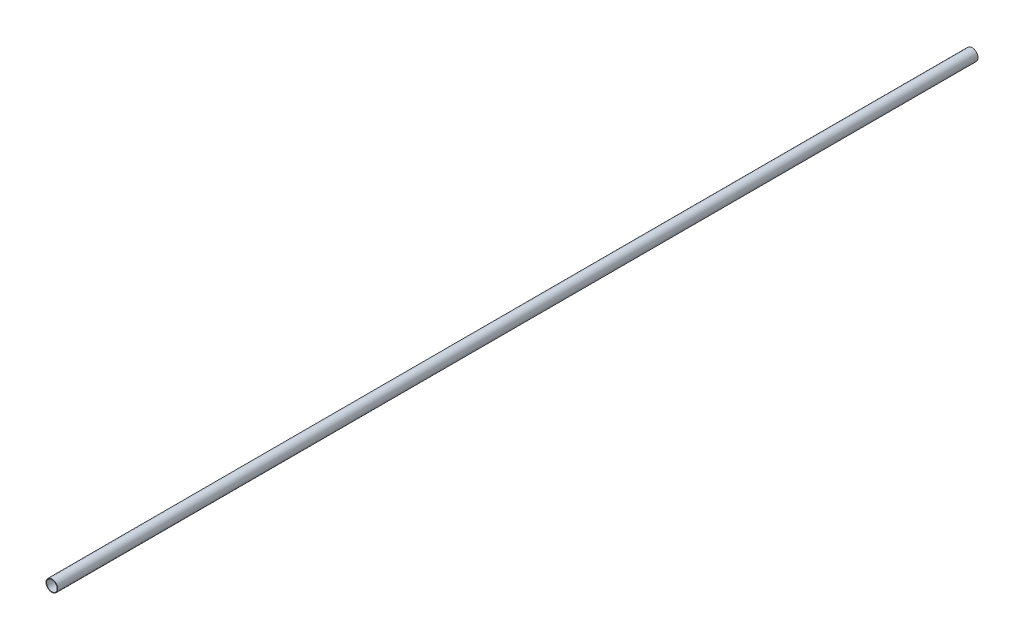
ISO-10303-21;
HEADER;
FILE_DESCRIPTION(('STEP AP214'),'2;1');
FILE_NAME('part.step','',(''),(''),'','','');
FILE_SCHEMA(('AUTOMOTIVE_DESIGN { 1 0 10303 214 1 1 1 1 }'));
ENDSEC;
DATA;
#1=APPLICATION_CONTEXT('core data for automotive mechanical design processes');
#2=APPLICATION_PROTOCOL_DEFINITION('international standard','automotive_design',2000,#1);
#3=PRODUCT_CONTEXT('',#1,'mechanical');
#4=PRODUCT('Part','Part','',(#3));
#5=PRODUCT_RELATED_PRODUCT_CATEGORY('part','',(#4));
#6=PRODUCT_DEFINITION_FORMATION('','',#4);
#7=PRODUCT_DEFINITION_CONTEXT('part definition',#1,'design');
#8=PRODUCT_DEFINITION('design','',#6,#7);
#9=PRODUCT_DEFINITION_SHAPE('','',#8);
#10=(LENGTH_UNIT() NAMED_UNIT(*) SI_UNIT(.MILLI.,.METRE.));
#11=(NAMED_UNIT(*) PLANE_ANGLE_UNIT() SI_UNIT($,.RADIAN.));
#12=(NAMED_UNIT(*) SI_UNIT($,.STERADIAN.) SOLID_ANGLE_UNIT());
#13=UNCERTAINTY_MEASURE_WITH_UNIT(LENGTH_MEASURE(1.E-05),#10,'distance_accuracy_value','');
#14=(GEOMETRIC_REPRESENTATION_CONTEXT(3) GLOBAL_UNCERTAINTY_ASSIGNED_CONTEXT((#13)) GLOBAL_UNIT_ASSIGNED_CONTEXT((#10,
#11,#12)) REPRESENTATION_CONTEXT('',''));
#15=CARTESIAN_POINT('',(0.,0.,0.));
#16=DIRECTION('',(0.,0.,1.));
#17=DIRECTION('',(1.,0.,0.));
#18=AXIS2_PLACEMENT_3D('',#15,#16,#17);
#19=CARTESIAN_POINT('',(0.,0.,392.));
#20=DIRECTION('',(0.,0.,1.));
#21=DIRECTION('',(1.,0.,0.));
#22=AXIS2_PLACEMENT_3D('',#19,#20,#21);
#23=PLANE('',#22);
#24=CARTESIAN_POINT('',(0.,0.,392.));
#25=DIRECTION('',(0.,0.,1.));
#26=DIRECTION('',(1.,0.,0.));
#27=AXIS2_PLACEMENT_3D('',#24,#25,#26);
#28=CIRCLE('',#27,5.);
#29=CARTESIAN_POINT('',(5.,0.,392.));
#30=VERTEX_POINT('',#29);
#31=EDGE_CURVE('E10',#30,#30,#28,.T.);
#32=ORIENTED_EDGE('',*,*,#31,.T.);
#33=EDGE_LOOP('',(#32));
#34=FACE_BOUND('',#33,.T.);
#35=CARTESIAN_POINT('',(0.,0.,392.));
#36=DIRECTION('',(0.,0.,1.));
#37=DIRECTION('',(1.,0.,0.));
#38=AXIS2_PLACEMENT_3D('',#35,#36,#37);
#39=CIRCLE('',#38,4.5);
#40=CARTESIAN_POINT('',(4.5,0.,392.));
#41=VERTEX_POINT('',#40);
#42=EDGE_CURVE('E42',#41,#41,#39,.T.);
#43=ORIENTED_EDGE('',*,*,#42,.F.);
#44=EDGE_LOOP('',(#43));
#45=FACE_BOUND('',#44,.T.);
#46=ADVANCED_FACE('F31',(#34,#45),#23,.T.);
#47=CARTESIAN_POINT('',(0.,0.,-392.));
#48=DIRECTION('',(0.,0.,1.));
#49=DIRECTION('',(1.,0.,0.));
#50=AXIS2_PLACEMENT_3D('',#47,#48,#49);
#51=PLANE('',#50);
#52=CARTESIAN_POINT('',(0.,0.,-392.));
#53=DIRECTION('',(0.,0.,1.));
#54=DIRECTION('',(1.,0.,0.));
#55=AXIS2_PLACEMENT_3D('',#52,#53,#54);
#56=CIRCLE('',#55,5.);
#57=CARTESIAN_POINT('',(5.,0.,-392.));
#58=VERTEX_POINT('',#57);
#59=EDGE_CURVE('E35',#58,#58,#56,.T.);
#60=ORIENTED_EDGE('',*,*,#59,.F.);
#61=EDGE_LOOP('',(#60));
#62=FACE_BOUND('',#61,.T.);
#63=CARTESIAN_POINT('',(0.,0.,-392.));
#64=DIRECTION('',(0.,0.,1.));
#65=DIRECTION('',(1.,0.,0.));
#66=AXIS2_PLACEMENT_3D('',#63,#64,#65);
#67=CIRCLE('',#66,4.5);
#68=CARTESIAN_POINT('',(4.5,0.,-392.));
#69=VERTEX_POINT('',#68);
#70=EDGE_CURVE('E44',#69,#69,#67,.T.);
#71=ORIENTED_EDGE('',*,*,#70,.T.);
#72=EDGE_LOOP('',(#71));
#73=FACE_BOUND('',#72,.T.);
#74=ADVANCED_FACE('F54',(#62,#73),#51,.F.);
#75=CARTESIAN_POINT('',(0.,0.,392.));
#76=DIRECTION('',(0.,0.,-1.));
#77=DIRECTION('',(-1.,0.,0.));
#78=AXIS2_PLACEMENT_3D('',#75,#76,#77);
#79=CYLINDRICAL_SURFACE('',#78,5.);
#80=ORIENTED_EDGE('',*,*,#31,.F.);
#81=EDGE_LOOP('',(#80));
#82=FACE_BOUND('',#81,.T.);
#83=ORIENTED_EDGE('',*,*,#59,.T.);
#84=EDGE_LOOP('',(#83));
#85=FACE_BOUND('',#84,.T.);
#86=ADVANCED_FACE('F33',(#82,#85),#79,.T.);
#87=CARTESIAN_POINT('',(0.,0.,392.));
#88=DIRECTION('',(0.,0.,-1.));
#89=DIRECTION('',(-1.,0.,0.));
#90=AXIS2_PLACEMENT_3D('',#87,#88,#89);
#91=CYLINDRICAL_SURFACE('',#90,4.5);
#92=ORIENTED_EDGE('',*,*,#42,.T.);
#93=EDGE_LOOP('',(#92));
#94=FACE_BOUND('',#93,.T.);
#95=ORIENTED_EDGE('',*,*,#70,.F.);
#96=EDGE_LOOP('',(#95));
#97=FACE_BOUND('',#96,.T.);
#98=ADVANCED_FACE('F50',(#94,#97),#91,.F.);
#99=CLOSED_SHELL('',(#46,#74,#86,#98));
#100=MANIFOLD_SOLID_BREP('B2',#99);
#101=ADVANCED_BREP_SHAPE_REPRESENTATION('',(#18,#100),#14);
#102=SHAPE_DEFINITION_REPRESENTATION(#9,#101);
ENDSEC;
END-ISO-10303-21;
